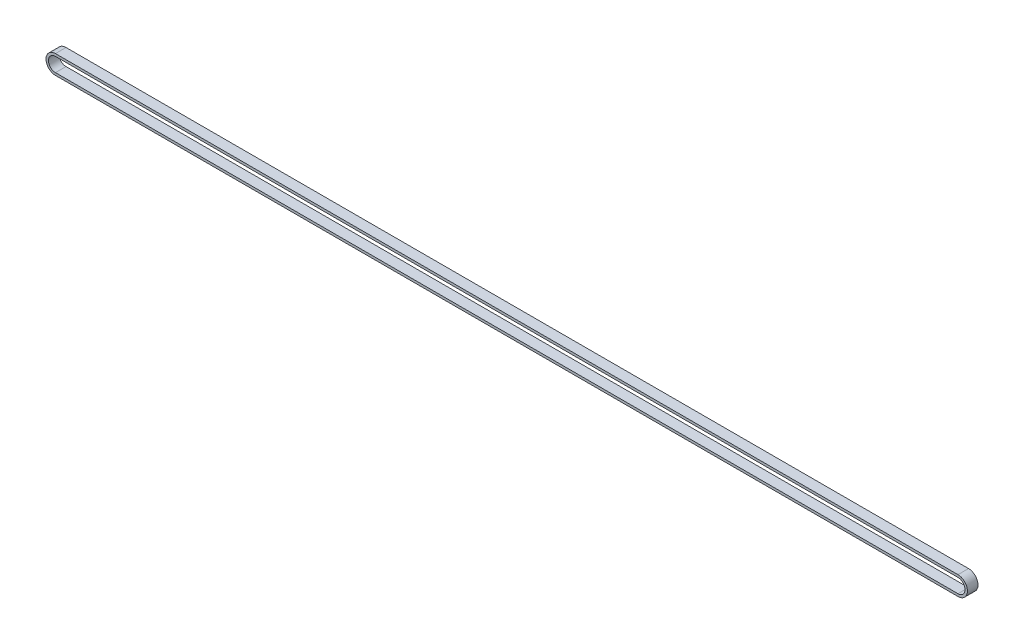
ISO-10303-21;
HEADER;
FILE_DESCRIPTION(('STEP AP214'),'2;1');
FILE_NAME('part.step','',(''),(''),'','','');
FILE_SCHEMA(('AUTOMOTIVE_DESIGN { 1 0 10303 214 1 1 1 1 }'));
ENDSEC;
DATA;
#1=APPLICATION_CONTEXT('core data for automotive mechanical design processes');
#2=APPLICATION_PROTOCOL_DEFINITION('international standard','automotive_design',2000,#1);
#3=PRODUCT_CONTEXT('',#1,'mechanical');
#4=PRODUCT('Part','Part','',(#3));
#5=PRODUCT_RELATED_PRODUCT_CATEGORY('part','',(#4));
#6=PRODUCT_DEFINITION_FORMATION('','',#4);
#7=PRODUCT_DEFINITION_CONTEXT('part definition',#1,'design');
#8=PRODUCT_DEFINITION('design','',#6,#7);
#9=PRODUCT_DEFINITION_SHAPE('','',#8);
#10=(LENGTH_UNIT() NAMED_UNIT(*) SI_UNIT(.MILLI.,.METRE.));
#11=(NAMED_UNIT(*) PLANE_ANGLE_UNIT() SI_UNIT($,.RADIAN.));
#12=(NAMED_UNIT(*) SI_UNIT($,.STERADIAN.) SOLID_ANGLE_UNIT());
#13=UNCERTAINTY_MEASURE_WITH_UNIT(LENGTH_MEASURE(1.E-05),#10,'distance_accuracy_value','');
#14=(GEOMETRIC_REPRESENTATION_CONTEXT(3) GLOBAL_UNCERTAINTY_ASSIGNED_CONTEXT((#13)) GLOBAL_UNIT_ASSIGNED_CONTEXT((#10,
#11,#12)) REPRESENTATION_CONTEXT('',''));
#15=CARTESIAN_POINT('',(0.,0.,0.));
#16=DIRECTION('',(0.,0.,1.));
#17=DIRECTION('',(1.,0.,0.));
#18=AXIS2_PLACEMENT_3D('',#15,#16,#17);
#19=CARTESIAN_POINT('',(-256.5,0.,6.));
#20=DIRECTION('',(0.,0.,1.));
#21=DIRECTION('',(1.,0.,0.));
#22=AXIS2_PLACEMENT_3D('',#19,#20,#21);
#23=PLANE('',#22);
#24=CARTESIAN_POINT('',(-256.5,0.,6.));
#25=DIRECTION('',(0.,0.,1.));
#26=DIRECTION('',(1.,0.,0.));
#27=AXIS2_PLACEMENT_3D('',#24,#25,#26);
#28=CIRCLE('',#27,5.38);
#29=CARTESIAN_POINT('',(-256.5,5.38,6.));
#30=VERTEX_POINT('',#29);
#31=CARTESIAN_POINT('',(-256.5,-5.38,6.));
#32=VERTEX_POINT('',#31);
#33=EDGE_CURVE('E134',#30,#32,#28,.T.);
#34=ORIENTED_EDGE('',*,*,#33,.T.);
#35=DIRECTION('',(1.,0.,0.));
#36=VECTOR('',#35,1.);
#37=CARTESIAN_POINT('',(-256.5,-5.38,6.));
#38=LINE('',#37,#36);
#39=CARTESIAN_POINT('',(256.5,-5.38,6.));
#40=VERTEX_POINT('',#39);
#41=EDGE_CURVE('E137',#32,#40,#38,.T.);
#42=ORIENTED_EDGE('',*,*,#41,.T.);
#43=CARTESIAN_POINT('',(256.5,0.,6.));
#44=DIRECTION('',(0.,0.,1.));
#45=DIRECTION('',(1.,0.,0.));
#46=AXIS2_PLACEMENT_3D('',#43,#44,#45);
#47=CIRCLE('',#46,5.38);
#48=CARTESIAN_POINT('',(256.5,5.38,6.));
#49=VERTEX_POINT('',#48);
#50=EDGE_CURVE('E140',#40,#49,#47,.T.);
#51=ORIENTED_EDGE('',*,*,#50,.T.);
#52=DIRECTION('',(-1.,0.,0.));
#53=VECTOR('',#52,1.);
#54=CARTESIAN_POINT('',(-256.5,5.38,6.));
#55=LINE('',#54,#53);
#56=EDGE_CURVE('E142',#49,#30,#55,.T.);
#57=ORIENTED_EDGE('',*,*,#56,.T.);
#58=EDGE_LOOP('',(#34,#42,#51,#57));
#59=FACE_BOUND('',#58,.T.);
#60=DIRECTION('',(-1.,0.,0.));
#61=VECTOR('',#60,1.);
#62=CARTESIAN_POINT('',(-256.5,4.,6.));
#63=LINE('',#62,#61);
#64=CARTESIAN_POINT('',(256.5,4.,6.));
#65=VERTEX_POINT('',#64);
#66=CARTESIAN_POINT('',(-256.5,4.,6.));
#67=VERTEX_POINT('',#66);
#68=EDGE_CURVE('E106',#65,#67,#63,.T.);
#69=ORIENTED_EDGE('',*,*,#68,.F.);
#70=CARTESIAN_POINT('',(256.5,0.,6.));
#71=DIRECTION('',(0.,0.,1.));
#72=DIRECTION('',(1.,0.,0.));
#73=AXIS2_PLACEMENT_3D('',#70,#71,#72);
#74=CIRCLE('',#73,4.);
#75=CARTESIAN_POINT('',(256.5,-4.,6.));
#76=VERTEX_POINT('',#75);
#77=EDGE_CURVE('E98',#76,#65,#74,.T.);
#78=ORIENTED_EDGE('',*,*,#77,.F.);
#79=DIRECTION('',(1.,0.,0.));
#80=VECTOR('',#79,1.);
#81=CARTESIAN_POINT('',(-256.5,-4.,6.));
#82=LINE('',#81,#80);
#83=CARTESIAN_POINT('',(-256.5,-4.,6.));
#84=VERTEX_POINT('',#83);
#85=EDGE_CURVE('E120',#84,#76,#82,.T.);
#86=ORIENTED_EDGE('',*,*,#85,.F.);
#87=CARTESIAN_POINT('',(-256.5,0.,6.));
#88=DIRECTION('',(0.,0.,1.));
#89=DIRECTION('',(1.,0.,0.));
#90=AXIS2_PLACEMENT_3D('',#87,#88,#89);
#91=CIRCLE('',#90,4.);
#92=EDGE_CURVE('E118',#67,#84,#91,.T.);
#93=ORIENTED_EDGE('',*,*,#92,.F.);
#94=EDGE_LOOP('',(#69,#78,#86,#93));
#95=FACE_BOUND('',#94,.T.);
#96=ADVANCED_FACE('F33',(#59,#95),#23,.T.);
#97=CARTESIAN_POINT('',(-256.5,0.,0.));
#98=DIRECTION('',(0.,0.,1.));
#99=DIRECTION('',(1.,0.,0.));
#100=AXIS2_PLACEMENT_3D('',#97,#98,#99);
#101=PLANE('',#100);
#102=CARTESIAN_POINT('',(-256.5,0.,0.));
#103=DIRECTION('',(0.,0.,1.));
#104=DIRECTION('',(1.,0.,0.));
#105=AXIS2_PLACEMENT_3D('',#102,#103,#104);
#106=CIRCLE('',#105,5.38);
#107=CARTESIAN_POINT('',(-256.5,5.38,0.));
#108=VERTEX_POINT('',#107);
#109=CARTESIAN_POINT('',(-256.5,-5.38,0.));
#110=VERTEX_POINT('',#109);
#111=EDGE_CURVE('E114',#108,#110,#106,.T.);
#112=ORIENTED_EDGE('',*,*,#111,.F.);
#113=DIRECTION('',(-1.,0.,0.));
#114=VECTOR('',#113,1.);
#115=CARTESIAN_POINT('',(-256.5,5.38,0.));
#116=LINE('',#115,#114);
#117=CARTESIAN_POINT('',(256.5,5.38,0.));
#118=VERTEX_POINT('',#117);
#119=EDGE_CURVE('E138',#118,#108,#116,.T.);
#120=ORIENTED_EDGE('',*,*,#119,.F.);
#121=CARTESIAN_POINT('',(256.5,0.,0.));
#122=DIRECTION('',(0.,0.,1.));
#123=DIRECTION('',(1.,0.,0.));
#124=AXIS2_PLACEMENT_3D('',#121,#122,#123);
#125=CIRCLE('',#124,5.38);
#126=CARTESIAN_POINT('',(256.5,-5.38,0.));
#127=VERTEX_POINT('',#126);
#128=EDGE_CURVE('E149',#127,#118,#125,.T.);
#129=ORIENTED_EDGE('',*,*,#128,.F.);
#130=DIRECTION('',(1.,0.,0.));
#131=VECTOR('',#130,1.);
#132=CARTESIAN_POINT('',(-256.5,-5.38,0.));
#133=LINE('',#132,#131);
#134=EDGE_CURVE('E147',#110,#127,#133,.T.);
#135=ORIENTED_EDGE('',*,*,#134,.F.);
#136=EDGE_LOOP('',(#112,#120,#129,#135));
#137=FACE_BOUND('',#136,.T.);
#138=CARTESIAN_POINT('',(256.5,0.,0.));
#139=DIRECTION('',(0.,0.,1.));
#140=DIRECTION('',(1.,0.,0.));
#141=AXIS2_PLACEMENT_3D('',#138,#139,#140);
#142=CIRCLE('',#141,4.);
#143=CARTESIAN_POINT('',(256.5,-4.,0.));
#144=VERTEX_POINT('',#143);
#145=CARTESIAN_POINT('',(256.5,4.,0.));
#146=VERTEX_POINT('',#145);
#147=EDGE_CURVE('E56',#144,#146,#142,.T.);
#148=ORIENTED_EDGE('',*,*,#147,.T.);
#149=DIRECTION('',(-1.,0.,0.));
#150=VECTOR('',#149,1.);
#151=CARTESIAN_POINT('',(-256.5,4.,0.));
#152=LINE('',#151,#150);
#153=CARTESIAN_POINT('',(-256.5,4.,0.));
#154=VERTEX_POINT('',#153);
#155=EDGE_CURVE('E113',#146,#154,#152,.T.);
#156=ORIENTED_EDGE('',*,*,#155,.T.);
#157=CARTESIAN_POINT('',(-256.5,0.,0.));
#158=DIRECTION('',(0.,0.,1.));
#159=DIRECTION('',(1.,0.,0.));
#160=AXIS2_PLACEMENT_3D('',#157,#158,#159);
#161=CIRCLE('',#160,4.);
#162=CARTESIAN_POINT('',(-256.5,-4.,0.));
#163=VERTEX_POINT('',#162);
#164=EDGE_CURVE('E126',#154,#163,#161,.T.);
#165=ORIENTED_EDGE('',*,*,#164,.T.);
#166=DIRECTION('',(1.,0.,0.));
#167=VECTOR('',#166,1.);
#168=CARTESIAN_POINT('',(-256.5,-4.,0.));
#169=LINE('',#168,#167);
#170=EDGE_CURVE('E107',#163,#144,#169,.T.);
#171=ORIENTED_EDGE('',*,*,#170,.T.);
#172=EDGE_LOOP('',(#148,#156,#165,#171));
#173=FACE_BOUND('',#172,.T.);
#174=ADVANCED_FACE('F167',(#137,#173),#101,.F.);
#175=CARTESIAN_POINT('',(-256.5,0.,6.));
#176=DIRECTION('',(0.,0.,-1.));
#177=DIRECTION('',(-1.,0.,0.));
#178=AXIS2_PLACEMENT_3D('',#175,#176,#177);
#179=CYLINDRICAL_SURFACE('',#178,5.38);
#180=ORIENTED_EDGE('',*,*,#111,.T.);
#181=DIRECTION('',(0.,0.,-1.));
#182=VECTOR('',#181,1.);
#183=CARTESIAN_POINT('',(-256.5,-5.38,6.));
#184=LINE('',#183,#182);
#185=EDGE_CURVE('E11',#32,#110,#184,.T.);
#186=ORIENTED_EDGE('',*,*,#185,.F.);
#187=ORIENTED_EDGE('',*,*,#33,.F.);
#188=DIRECTION('',(0.,0.,-1.));
#189=VECTOR('',#188,1.);
#190=CARTESIAN_POINT('',(-256.5,5.38,6.));
#191=LINE('',#190,#189);
#192=EDGE_CURVE('E144',#30,#108,#191,.T.);
#193=ORIENTED_EDGE('',*,*,#192,.T.);
#194=EDGE_LOOP('',(#180,#186,#187,#193));
#195=FACE_BOUND('',#194,.T.);
#196=ADVANCED_FACE('F35',(#195),#179,.T.);
#197=CARTESIAN_POINT('',(-256.5,-5.38,6.));
#198=DIRECTION('',(0.,1.,0.));
#199=DIRECTION('',(0.,0.,1.));
#200=AXIS2_PLACEMENT_3D('',#197,#198,#199);
#201=PLANE('',#200);
#202=ORIENTED_EDGE('',*,*,#134,.T.);
#203=DIRECTION('',(0.,0.,-1.));
#204=VECTOR('',#203,1.);
#205=CARTESIAN_POINT('',(256.5,-5.38,6.));
#206=LINE('',#205,#204);
#207=EDGE_CURVE('E41',#40,#127,#206,.T.);
#208=ORIENTED_EDGE('',*,*,#207,.F.);
#209=ORIENTED_EDGE('',*,*,#41,.F.);
#210=ORIENTED_EDGE('',*,*,#185,.T.);
#211=EDGE_LOOP('',(#202,#208,#209,#210));
#212=FACE_BOUND('',#211,.T.);
#213=ADVANCED_FACE('F177',(#212),#201,.F.);
#214=CARTESIAN_POINT('',(256.5,0.,6.));
#215=DIRECTION('',(0.,0.,-1.));
#216=DIRECTION('',(-1.,0.,0.));
#217=AXIS2_PLACEMENT_3D('',#214,#215,#216);
#218=CYLINDRICAL_SURFACE('',#217,5.38);
#219=ORIENTED_EDGE('',*,*,#128,.T.);
#220=DIRECTION('',(0.,0.,-1.));
#221=VECTOR('',#220,1.);
#222=CARTESIAN_POINT('',(256.5,5.38,6.));
#223=LINE('',#222,#221);
#224=EDGE_CURVE('E154',#49,#118,#223,.T.);
#225=ORIENTED_EDGE('',*,*,#224,.F.);
#226=ORIENTED_EDGE('',*,*,#50,.F.);
#227=ORIENTED_EDGE('',*,*,#207,.T.);
#228=EDGE_LOOP('',(#219,#225,#226,#227));
#229=FACE_BOUND('',#228,.T.);
#230=ADVANCED_FACE('F161',(#229),#218,.T.);
#231=CARTESIAN_POINT('',(-256.5,5.38,6.));
#232=DIRECTION('',(0.,-1.,0.));
#233=DIRECTION('',(0.,0.,-1.));
#234=AXIS2_PLACEMENT_3D('',#231,#232,#233);
#235=PLANE('',#234);
#236=ORIENTED_EDGE('',*,*,#119,.T.);
#237=ORIENTED_EDGE('',*,*,#192,.F.);
#238=ORIENTED_EDGE('',*,*,#56,.F.);
#239=ORIENTED_EDGE('',*,*,#224,.T.);
#240=EDGE_LOOP('',(#236,#237,#238,#239));
#241=FACE_BOUND('',#240,.T.);
#242=ADVANCED_FACE('F171',(#241),#235,.F.);
#243=CARTESIAN_POINT('',(256.5,0.,6.));
#244=DIRECTION('',(0.,0.,-1.));
#245=DIRECTION('',(-1.,0.,0.));
#246=AXIS2_PLACEMENT_3D('',#243,#244,#245);
#247=CYLINDRICAL_SURFACE('',#246,4.);
#248=ORIENTED_EDGE('',*,*,#147,.F.);
#249=DIRECTION('',(0.,0.,-1.));
#250=VECTOR('',#249,1.);
#251=CARTESIAN_POINT('',(256.5,-4.,6.));
#252=LINE('',#251,#250);
#253=EDGE_CURVE('E102',#76,#144,#252,.T.);
#254=ORIENTED_EDGE('',*,*,#253,.F.);
#255=ORIENTED_EDGE('',*,*,#77,.T.);
#256=DIRECTION('',(0.,0.,-1.));
#257=VECTOR('',#256,1.);
#258=CARTESIAN_POINT('',(256.5,4.,6.));
#259=LINE('',#258,#257);
#260=EDGE_CURVE('E101',#65,#146,#259,.T.);
#261=ORIENTED_EDGE('',*,*,#260,.T.);
#262=EDGE_LOOP('',(#248,#254,#255,#261));
#263=FACE_BOUND('',#262,.T.);
#264=ADVANCED_FACE('F100',(#263),#247,.F.);
#265=CARTESIAN_POINT('',(-256.5,4.,6.));
#266=DIRECTION('',(0.,-1.,0.));
#267=DIRECTION('',(1.,0.,0.));
#268=AXIS2_PLACEMENT_3D('',#265,#266,#267);
#269=PLANE('',#268);
#270=ORIENTED_EDGE('',*,*,#155,.F.);
#271=ORIENTED_EDGE('',*,*,#260,.F.);
#272=ORIENTED_EDGE('',*,*,#68,.T.);
#273=DIRECTION('',(0.,0.,-1.));
#274=VECTOR('',#273,1.);
#275=CARTESIAN_POINT('',(-256.5,4.,6.));
#276=LINE('',#275,#274);
#277=EDGE_CURVE('E115',#67,#154,#276,.T.);
#278=ORIENTED_EDGE('',*,*,#277,.T.);
#279=EDGE_LOOP('',(#270,#271,#272,#278));
#280=FACE_BOUND('',#279,.T.);
#281=ADVANCED_FACE('F110',(#280),#269,.T.);
#282=CARTESIAN_POINT('',(-256.5,0.,6.));
#283=DIRECTION('',(0.,0.,-1.));
#284=DIRECTION('',(-1.,0.,0.));
#285=AXIS2_PLACEMENT_3D('',#282,#283,#284);
#286=CYLINDRICAL_SURFACE('',#285,4.);
#287=ORIENTED_EDGE('',*,*,#164,.F.);
#288=ORIENTED_EDGE('',*,*,#277,.F.);
#289=ORIENTED_EDGE('',*,*,#92,.T.);
#290=DIRECTION('',(0.,0.,-1.));
#291=VECTOR('',#290,1.);
#292=CARTESIAN_POINT('',(-256.5,-4.,6.));
#293=LINE('',#292,#291);
#294=EDGE_CURVE('E48',#84,#163,#293,.T.);
#295=ORIENTED_EDGE('',*,*,#294,.T.);
#296=EDGE_LOOP('',(#287,#288,#289,#295));
#297=FACE_BOUND('',#296,.T.);
#298=ADVANCED_FACE('F200',(#297),#286,.F.);
#299=CARTESIAN_POINT('',(-256.5,-4.,6.));
#300=DIRECTION('',(0.,1.,0.));
#301=DIRECTION('',(0.,0.,1.));
#302=AXIS2_PLACEMENT_3D('',#299,#300,#301);
#303=PLANE('',#302);
#304=ORIENTED_EDGE('',*,*,#170,.F.);
#305=ORIENTED_EDGE('',*,*,#294,.F.);
#306=ORIENTED_EDGE('',*,*,#85,.T.);
#307=ORIENTED_EDGE('',*,*,#253,.T.);
#308=EDGE_LOOP('',(#304,#305,#306,#307));
#309=FACE_BOUND('',#308,.T.);
#310=ADVANCED_FACE('F204',(#309),#303,.T.);
#311=CLOSED_SHELL('',(#96,#174,#196,#213,#230,#242,#264,#281,#298,#310));
#312=MANIFOLD_SOLID_BREP('B2',#311);
#313=ADVANCED_BREP_SHAPE_REPRESENTATION('',(#18,#312),#14);
#314=SHAPE_DEFINITION_REPRESENTATION(#9,#313);
ENDSEC;
END-ISO-10303-21;
